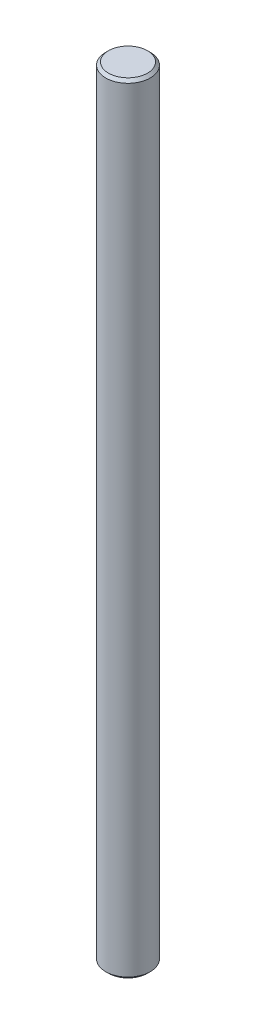
ISO-10303-21;
HEADER;
FILE_DESCRIPTION(('STEP AP214'),'2;1');
FILE_NAME('part.step','',(''),(''),'','','');
FILE_SCHEMA(('AUTOMOTIVE_DESIGN { 1 0 10303 214 1 1 1 1 }'));
ENDSEC;
DATA;
#1=APPLICATION_CONTEXT('core data for automotive mechanical design processes');
#2=APPLICATION_PROTOCOL_DEFINITION('international standard','automotive_design',2000,#1);
#3=PRODUCT_CONTEXT('',#1,'mechanical');
#4=PRODUCT('Part','Part','',(#3));
#5=PRODUCT_RELATED_PRODUCT_CATEGORY('part','',(#4));
#6=PRODUCT_DEFINITION_FORMATION('','',#4);
#7=PRODUCT_DEFINITION_CONTEXT('part definition',#1,'design');
#8=PRODUCT_DEFINITION('design','',#6,#7);
#9=PRODUCT_DEFINITION_SHAPE('','',#8);
#10=(LENGTH_UNIT() NAMED_UNIT(*) SI_UNIT(.MILLI.,.METRE.));
#11=(NAMED_UNIT(*) PLANE_ANGLE_UNIT() SI_UNIT($,.RADIAN.));
#12=(NAMED_UNIT(*) SI_UNIT($,.STERADIAN.) SOLID_ANGLE_UNIT());
#13=UNCERTAINTY_MEASURE_WITH_UNIT(LENGTH_MEASURE(1.E-05),#10,'distance_accuracy_value','');
#14=(GEOMETRIC_REPRESENTATION_CONTEXT(3) GLOBAL_UNCERTAINTY_ASSIGNED_CONTEXT((#13)) GLOBAL_UNIT_ASSIGNED_CONTEXT((#10,
#11,#12)) REPRESENTATION_CONTEXT('',''));
#15=CARTESIAN_POINT('',(0.,0.,0.));
#16=DIRECTION('',(0.,0.,1.));
#17=DIRECTION('',(1.,0.,0.));
#18=AXIS2_PLACEMENT_3D('',#15,#16,#17);
#19=CARTESIAN_POINT('',(0.,140.,0.));
#20=DIRECTION('',(0.,-1.,0.));
#21=DIRECTION('',(0.,0.,-1.));
#22=AXIS2_PLACEMENT_3D('',#19,#20,#21);
#23=CYLINDRICAL_SURFACE('',#22,4.);
#24=CARTESIAN_POINT('',(0.,0.500000000000028,0.));
#25=DIRECTION('',(0.,1.,0.));
#26=DIRECTION('',(0.,0.,1.));
#27=AXIS2_PLACEMENT_3D('',#24,#25,#26);
#28=CIRCLE('',#27,4.);
#29=CARTESIAN_POINT('',(0.,0.500000000000028,4.));
#30=VERTEX_POINT('',#29);
#31=EDGE_CURVE('E41',#30,#30,#28,.T.);
#32=ORIENTED_EDGE('',*,*,#31,.T.);
#33=EDGE_LOOP('',(#32));
#34=FACE_BOUND('',#33,.T.);
#35=CARTESIAN_POINT('',(0.,139.5,0.));
#36=DIRECTION('',(0.,1.,0.));
#37=DIRECTION('',(0.,0.,1.));
#38=AXIS2_PLACEMENT_3D('',#35,#36,#37);
#39=CIRCLE('',#38,4.);
#40=CARTESIAN_POINT('',(0.,139.5,4.));
#41=VERTEX_POINT('',#40);
#42=EDGE_CURVE('E45',#41,#41,#39,.F.);
#43=ORIENTED_EDGE('',*,*,#42,.T.);
#44=EDGE_LOOP('',(#43));
#45=FACE_BOUND('',#44,.T.);
#46=ADVANCED_FACE('F30',(#34,#45),#23,.T.);
#47=CARTESIAN_POINT('',(0.,140.,0.));
#48=DIRECTION('',(0.,1.,0.));
#49=DIRECTION('',(0.,0.,1.));
#50=AXIS2_PLACEMENT_3D('',#47,#48,#49);
#51=PLANE('',#50);
#52=CARTESIAN_POINT('',(0.,140.,0.));
#53=DIRECTION('',(0.,1.,0.));
#54=DIRECTION('',(0.,0.,1.));
#55=AXIS2_PLACEMENT_3D('',#52,#53,#54);
#56=CIRCLE('',#55,3.50000000000004);
#57=CARTESIAN_POINT('',(0.,140.,3.50000000000004));
#58=VERTEX_POINT('',#57);
#59=EDGE_CURVE('E10',#58,#58,#56,.T.);
#60=ORIENTED_EDGE('',*,*,#59,.T.);
#61=EDGE_LOOP('',(#60));
#62=FACE_BOUND('',#61,.T.);
#63=ADVANCED_FACE('F61',(#62),#51,.T.);
#64=CARTESIAN_POINT('',(0.,0.,0.));
#65=DIRECTION('',(0.,1.,0.));
#66=DIRECTION('',(0.,0.,1.));
#67=AXIS2_PLACEMENT_3D('',#64,#65,#66);
#68=PLANE('',#67);
#69=CARTESIAN_POINT('',(0.,0.,0.));
#70=DIRECTION('',(0.,1.,0.));
#71=DIRECTION('',(0.,0.,1.));
#72=AXIS2_PLACEMENT_3D('',#69,#70,#71);
#73=CIRCLE('',#72,3.49999999999998);
#74=CARTESIAN_POINT('',(0.,0.,3.49999999999998));
#75=VERTEX_POINT('',#74);
#76=EDGE_CURVE('E37',#75,#75,#73,.F.);
#77=ORIENTED_EDGE('',*,*,#76,.T.);
#78=EDGE_LOOP('',(#77));
#79=FACE_BOUND('',#78,.T.);
#80=ADVANCED_FACE('F58',(#79),#68,.F.);
#81=CARTESIAN_POINT('',(0.,0.500000000000028,0.));
#82=DIRECTION('',(0.,1.,0.));
#83=DIRECTION('',(0.,0.,1.));
#84=AXIS2_PLACEMENT_3D('',#81,#82,#83);
#85=CONICAL_SURFACE('',#84,4.,0.785398163397445);
#86=ORIENTED_EDGE('',*,*,#76,.F.);
#87=EDGE_LOOP('',(#86));
#88=FACE_BOUND('',#87,.T.);
#89=ORIENTED_EDGE('',*,*,#31,.F.);
#90=EDGE_LOOP('',(#89));
#91=FACE_BOUND('',#90,.T.);
#92=ADVANCED_FACE('F54',(#88,#91),#85,.T.);
#93=CARTESIAN_POINT('',(0.,140.,0.));
#94=DIRECTION('',(0.,-1.,0.));
#95=DIRECTION('',(0.,0.,-1.));
#96=AXIS2_PLACEMENT_3D('',#93,#94,#95);
#97=CONICAL_SURFACE('',#96,3.50000000000004,0.785398163397459);
#98=ORIENTED_EDGE('',*,*,#42,.F.);
#99=EDGE_LOOP('',(#98));
#100=FACE_BOUND('',#99,.T.);
#101=ORIENTED_EDGE('',*,*,#59,.F.);
#102=EDGE_LOOP('',(#101));
#103=FACE_BOUND('',#102,.T.);
#104=ADVANCED_FACE('F32',(#100,#103),#97,.T.);
#105=CLOSED_SHELL('',(#46,#63,#80,#92,#104));
#106=MANIFOLD_SOLID_BREP('B2',#105);
#107=ADVANCED_BREP_SHAPE_REPRESENTATION('',(#18,#106),#14);
#108=SHAPE_DEFINITION_REPRESENTATION(#9,#107);
ENDSEC;
END-ISO-10303-21;
